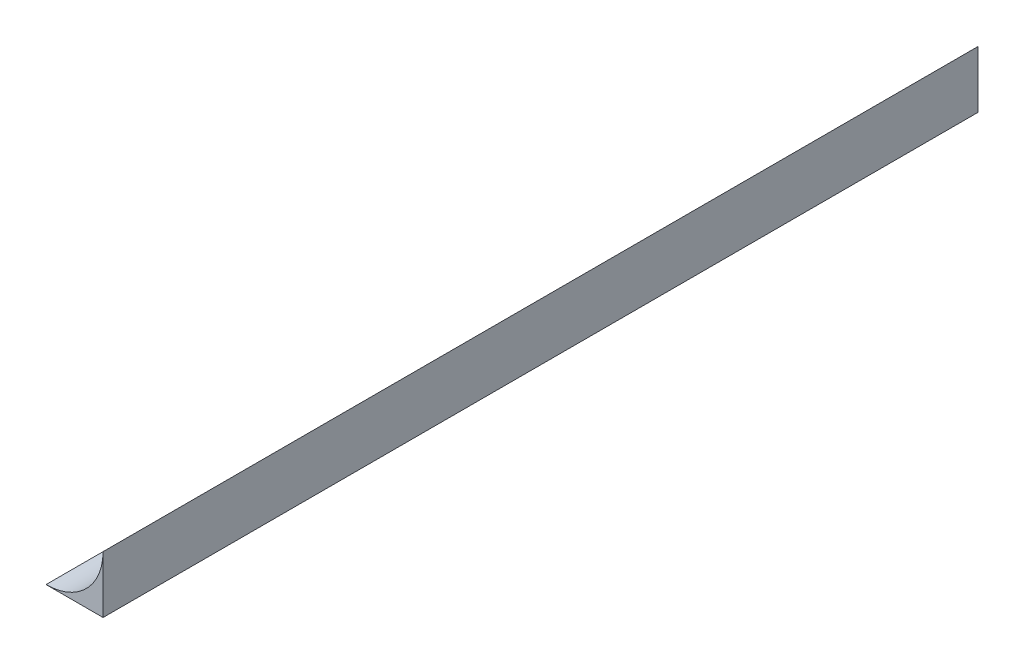
ISO-10303-21;
HEADER;
FILE_DESCRIPTION(('STEP AP214'),'2;1');
FILE_NAME('part.step','',(''),(''),'','','');
FILE_SCHEMA(('AUTOMOTIVE_DESIGN { 1 0 10303 214 1 1 1 1 }'));
ENDSEC;
DATA;
#1=APPLICATION_CONTEXT('core data for automotive mechanical design processes');
#2=APPLICATION_PROTOCOL_DEFINITION('international standard','automotive_design',2000,#1);
#3=PRODUCT_CONTEXT('',#1,'mechanical');
#4=PRODUCT('Part','Part','',(#3));
#5=PRODUCT_RELATED_PRODUCT_CATEGORY('part','',(#4));
#6=PRODUCT_DEFINITION_FORMATION('','',#4);
#7=PRODUCT_DEFINITION_CONTEXT('part definition',#1,'design');
#8=PRODUCT_DEFINITION('design','',#6,#7);
#9=PRODUCT_DEFINITION_SHAPE('','',#8);
#10=(LENGTH_UNIT() NAMED_UNIT(*) SI_UNIT(.MILLI.,.METRE.));
#11=(NAMED_UNIT(*) PLANE_ANGLE_UNIT() SI_UNIT($,.RADIAN.));
#12=(NAMED_UNIT(*) SI_UNIT($,.STERADIAN.) SOLID_ANGLE_UNIT());
#13=UNCERTAINTY_MEASURE_WITH_UNIT(LENGTH_MEASURE(1.E-05),#10,'distance_accuracy_value','');
#14=(GEOMETRIC_REPRESENTATION_CONTEXT(3) GLOBAL_UNCERTAINTY_ASSIGNED_CONTEXT((#13)) GLOBAL_UNIT_ASSIGNED_CONTEXT((#10,
#11,#12)) REPRESENTATION_CONTEXT('',''));
#15=CARTESIAN_POINT('',(0.,0.,0.));
#16=DIRECTION('',(0.,0.,1.));
#17=DIRECTION('',(1.,0.,0.));
#18=AXIS2_PLACEMENT_3D('',#15,#16,#17);
#19=CARTESIAN_POINT('',(-130.,52.0000000000002,0.));
#20=DIRECTION('',(0.,0.,1.));
#21=DIRECTION('',(0.,-1.,0.));
#22=AXIS2_PLACEMENT_3D('',#19,#20,#21);
#23=CYLINDRICAL_SURFACE('',#22,15.);
#24=CARTESIAN_POINT('',(-121.,40.,73.));
#25=CARTESIAN_POINT('',(-120.797057072228,40.1522174054446,72.9999977927953));
#26=CARTESIAN_POINT('',(-120.597701329312,40.3098633624881,72.9793924118525));
#27=CARTESIAN_POINT('',(-120.308154316818,40.55080060245,72.9208094612382));
#28=CARTESIAN_POINT('',(-120.213030786577,40.632032353957,72.8965894837349));
#29=CARTESIAN_POINT('',(-120.026317009639,40.7954927156775,72.8392717260157));
#30=CARTESIAN_POINT('',(-119.934726738886,40.8777213190987,72.8061740062583));
#31=CARTESIAN_POINT('',(-119.74905229858,41.0485104279241,72.7287307262232));
#32=CARTESIAN_POINT('',(-119.655262765118,41.1371008698239,72.683747268262));
#33=CARTESIAN_POINT('',(-119.472661372362,41.313967620845,72.5841916306262));
#34=CARTESIAN_POINT('',(-119.383848085223,41.4022440131981,72.529622220243));
#35=CARTESIAN_POINT('',(-119.21169083469,41.5775503289673,72.4109895595326));
#36=CARTESIAN_POINT('',(-119.128341454555,41.6645814178977,72.3469359233702));
#37=CARTESIAN_POINT('',(-118.967575577733,41.836366181023,72.2091738414463));
#38=CARTESIAN_POINT('',(-118.890156448988,41.9211208545985,72.1354697187337));
#39=CARTESIAN_POINT('',(-118.718528414286,42.1131534550002,71.9532373542073));
#40=CARTESIAN_POINT('',(-118.626694581793,42.2191338527398,71.8410462657974));
#41=CARTESIAN_POINT('',(-118.456758060844,42.4202913252589,71.5980760338289));
#42=CARTESIAN_POINT('',(-118.378633729717,42.5154853423484,71.4673267885637));
#43=CARTESIAN_POINT('',(-118.258998930605,42.6642948092194,71.2246767882859));
#44=CARTESIAN_POINT('',(-118.213325827111,42.7221486721382,71.117464061298));
#45=CARTESIAN_POINT('',(-118.133467450503,42.8245098489895,70.8928229685946));
#46=CARTESIAN_POINT('',(-118.099263285226,42.869039098688,70.7754118079922));
#47=CARTESIAN_POINT('',(-118.049957820365,42.9336972245061,70.5545946442233));
#48=CARTESIAN_POINT('',(-118.032495563605,42.9568131623828,70.4526050032231));
#49=CARTESIAN_POINT('',(-118.008220744942,42.9890259608883,70.245204380083));
#50=CARTESIAN_POINT('',(-118.001398509047,42.9981355560867,70.1397965948797));
#51=CARTESIAN_POINT('',(-117.998989187519,43.0013475264529,69.9284107226748));
#52=CARTESIAN_POINT('',(-118.003423807159,42.9954209090684,69.8224319276819));
#53=CARTESIAN_POINT('',(-118.023167799293,42.9691780704006,69.613305538068));
#54=CARTESIAN_POINT('',(-118.03848590117,42.948850298332,69.5101602851857));
#55=CARTESIAN_POINT('',(-118.083506289404,42.8896301139918,69.2858510667955));
#56=CARTESIAN_POINT('',(-118.115719614978,42.8475268479826,69.166051855412));
#57=CARTESIAN_POINT('',(-118.19217759987,42.749096679101,68.9365904688598));
#58=CARTESIAN_POINT('',(-118.236445886728,42.6927418590395,68.826948773882));
#59=CARTESIAN_POINT('',(-118.358174512877,42.5405443051896,68.568259036926));
#60=CARTESIAN_POINT('',(-118.441378215187,42.4387148745273,68.4254821808397));
#61=CARTESIAN_POINT('',(-118.623878875643,42.2222683932134,68.1615553679394));
#62=CARTESIAN_POINT('',(-118.723212124078,42.1076226924612,68.0404555054716));
#63=CARTESIAN_POINT('',(-118.904493312211,41.9053198630733,67.8504063180705));
#64=CARTESIAN_POINT('',(-118.983229705148,41.819379026753,67.7764730701752));
#65=CARTESIAN_POINT('',(-119.146727522353,41.6452556460058,67.6384676120057));
#66=CARTESIAN_POINT('',(-119.231491287131,41.5570722393912,67.574399263311));
#67=CARTESIAN_POINT('',(-119.406537240407,41.3795430651524,67.4559782340394));
#68=CARTESIAN_POINT('',(-119.496823141455,41.2901965480501,67.4016321883171));
#69=CARTESIAN_POINT('',(-119.682406740321,41.1112958256178,67.3027794646786));
#70=CARTESIAN_POINT('',(-119.77770376302,41.0217416498106,67.258271465521));
#71=CARTESIAN_POINT('',(-119.974285274796,40.8419068981934,67.1787752777045));
#72=CARTESIAN_POINT('',(-120.075635921277,40.7516342612607,67.1439324029462));
#73=CARTESIAN_POINT('',(-120.28255188401,40.5724045968713,67.0850665817684));
#74=CARTESIAN_POINT('',(-120.388116892609,40.4834474740274,67.0610428471014));
#75=CARTESIAN_POINT('',(-120.602731025415,40.3076719584561,67.0244316344465));
#76=CARTESIAN_POINT('',(-120.711775208581,40.2208508178736,67.0118286252978));
#77=CARTESIAN_POINT('',(-120.932664859562,40.0499810640971,66.9987158790101));
#78=CARTESIAN_POINT('',(-121.044509508771,39.9659316569621,66.9982026482706));
#79=CARTESIAN_POINT('',(-121.331738655649,39.7563198605775,67.0132887243839));
#80=CARTESIAN_POINT('',(-121.508497682384,39.6331268770398,67.0378315160276));
#81=CARTESIAN_POINT('',(-121.861753219254,39.3978634308245,67.1207292322723));
#82=CARTESIAN_POINT('',(-122.038249796266,39.2857893492501,67.1790731129833));
#83=CARTESIAN_POINT('',(-122.298214359706,39.127819307445,67.2937561058334));
#84=CARTESIAN_POINT('',(-122.384482592007,39.0766276813842,67.3367899360425));
#85=CARTESIAN_POINT('',(-122.554096112296,38.9781687426978,67.432076800961));
#86=CARTESIAN_POINT('',(-122.637442919537,38.9308993723233,67.4843249559743));
#87=CARTESIAN_POINT('',(-122.800044458511,38.840619426391,67.5979844758074));
#88=CARTESIAN_POINT('',(-122.879300867386,38.7976070986175,67.6593920442639));
#89=CARTESIAN_POINT('',(-123.032530492183,38.7161039132678,67.7911491508635));
#90=CARTESIAN_POINT('',(-123.106504816182,38.6776121062765,67.8614968048945));
#91=CARTESIAN_POINT('',(-123.237484896901,38.6107140831353,67.999664938308));
#92=CARTESIAN_POINT('',(-123.295383895437,38.5816577367595,68.0663268567764));
#93=CARTESIAN_POINT('',(-123.405680954729,38.5271109064594,68.2054042050856));
#94=CARTESIAN_POINT('',(-123.45807990364,38.5016198465857,68.2778187026633));
#95=CARTESIAN_POINT('',(-123.556637578558,38.4542969201322,68.4278515352118));
#96=CARTESIAN_POINT('',(-123.602799734153,38.4324630408854,68.5054669747852));
#97=CARTESIAN_POINT('',(-123.688252239388,38.3924998834528,68.6652629761306));
#98=CARTESIAN_POINT('',(-123.727543232625,38.3743702582754,68.7474431093924));
#99=CARTESIAN_POINT('',(-123.826064973673,38.3293244261949,68.9804853829526));
#100=CARTESIAN_POINT('',(-123.877401977517,38.3063688379322,69.1355769002148));
#101=CARTESIAN_POINT('',(-123.954264918678,38.2722586667104,69.4531608308171));
#102=CARTESIAN_POINT('',(-123.979800305376,38.2610997633567,69.6156505119107));
#103=CARTESIAN_POINT('',(-124.00335678942,38.2508030303214,69.9350221061431));
#104=CARTESIAN_POINT('',(-124.002655965275,38.2511068101148,70.0917922749454));
#105=CARTESIAN_POINT('',(-123.976914708434,38.262364146139,70.4029142629871));
#106=CARTESIAN_POINT('',(-123.95187718616,38.2733164289173,70.5572663691595));
#107=CARTESIAN_POINT('',(-123.878858094909,38.3057244940787,70.8578406376436));
#108=CARTESIAN_POINT('',(-123.831077258623,38.3270884218057,71.0041216667716));
#109=CARTESIAN_POINT('',(-123.714641385584,38.3802225212054,71.2860758617496));
#110=CARTESIAN_POINT('',(-123.6459856759,38.4119930283515,71.4217486854519));
#111=CARTESIAN_POINT('',(-123.488866162904,38.4865685425927,71.6820082882229));
#112=CARTESIAN_POINT('',(-123.400002588645,38.5295993374239,71.8062883252061));
#113=CARTESIAN_POINT('',(-123.206922851938,38.6259309548717,72.0376989264209));
#114=CARTESIAN_POINT('',(-123.102704871565,38.6792329938102,72.1448274568156));
#115=CARTESIAN_POINT('',(-122.87614414781,38.7989387141019,72.3461454519451));
#116=CARTESIAN_POINT('',(-122.75309043645,38.8659350197007,72.4391789973649));
#117=CARTESIAN_POINT('',(-122.498414412184,39.009710619008,72.6034112360307));
#118=CARTESIAN_POINT('',(-122.366786464314,39.0864963786976,72.6745953907881));
#119=CARTESIAN_POINT('',(-122.084109099931,39.2575949899679,72.8020257215924));
#120=CARTESIAN_POINT('',(-121.932527280025,39.3529073472835,72.8557317381524));
#121=CARTESIAN_POINT('',(-121.628389326607,39.5521422204349,72.9376730783265));
#122=CARTESIAN_POINT('',(-121.475834007175,39.6560582390291,72.9659274341675));
#123=CARTESIAN_POINT('',(-121.270065892474,39.8019369602416,72.9883228220883));
#124=CARTESIAN_POINT('',(-121.215732439846,39.8410066003587,72.9927239962523));
#125=CARTESIAN_POINT('',(-121.107515940377,39.9199246847551,72.9985622167554));
#126=CARTESIAN_POINT('',(-121.053632703586,39.9597727741666,73.0000005833086));
#127=CARTESIAN_POINT('',(-121.,40.,73.));
#128=B_SPLINE_CURVE_WITH_KNOTS('',3,(#24,#25,#26,#27,#28,#29,#30,#31,#32,#33,#34,#35,#36,#37,
#38,#39,#40,#41,#42,#43,#44,#45,#46,#47,#48,#49,#50,#51,#52,#53,#54,#55,#56,#57,#58,#59,#60,#61,
#62,#63,#64,#65,#66,#67,#68,#69,#70,#71,#72,#73,#74,#75,#76,#77,#78,#79,#80,#81,#82,#83,#84,#85,
#86,#87,#88,#89,#90,#91,#92,#93,#94,#95,#96,#97,#98,#99,#100,#101,#102,#103,#104,#105,#106,#107,
#108,#109,#110,#111,#112,#113,#114,#115,#116,#117,#118,#119,#120,#121,#122,#123,#124,#125,#126,
#127),.UNSPECIFIED.,.T.,.F.,(4,2,2,2,2,2,2,2,2,2,2,2,2,2,2,2,2,2,2,2,2,2,2,2,2,2,2,2,2,2,2,2,2,
2,2,2,2,2,2,2,2,2,2,2,2,2,2,2,2,2,2,4),(0.,0.760786666743888,1.14278137474352,1.52477348137761,
1.93424732350509,2.34360306645045,2.75254665074153,3.16130766671145,3.69859728150022,
4.23503091396096,4.62411272265274,5.01255043264049,5.32927360238405,5.64570863671824,
5.96275427887032,6.28005450327093,6.67089820437208,7.06251353639037,7.64165606743534,
8.22212015619734,8.63571091220358,9.04946315747914,9.46349669413512,9.87747459260754,
10.297375411655,10.7172456331342,11.1365440081959,11.5557212165229,12.2035941201185,
12.8512554623346,13.1783019870993,13.5051758327483,13.8319145713563,14.158584564006,
14.4370560730471,14.7154825446987,14.9937552820385,15.2720019405549,15.7641670401542,
16.2561518276675,16.7242026154998,17.1921974361116,17.6561362277301,18.1200899766601,
18.5941739905638,19.068314180091,19.5707907770604,20.0736009985509,20.6323046424333,
21.1905901516038,21.3917365524228,21.592793303882),.UNSPECIFIED.);
#129=CARTESIAN_POINT('',(-121.,40.,73.));
#130=VERTEX_POINT('',#129);
#131=EDGE_CURVE('E103',#130,#130,#128,.T.);
#132=ORIENTED_EDGE('',*,*,#131,.F.);
#133=EDGE_LOOP('',(#132));
#134=FACE_BOUND('',#133,.T.);
#135=CARTESIAN_POINT('',(-130.,52.0000000000003,-115.));
#136=DIRECTION('',(0.,0.,-1.));
#137=DIRECTION('',(-1.,0.,0.));
#138=AXIS2_PLACEMENT_3D('',#135,#136,#137);
#139=CIRCLE('',#138,15.);
#140=CARTESIAN_POINT('',(-130.,37.0000000000002,-115.));
#141=VERTEX_POINT('',#140);
#142=CARTESIAN_POINT('',(-115.,52.0000000000003,-115.));
#143=VERTEX_POINT('',#142);
#144=EDGE_CURVE('E12',#141,#143,#139,.F.);
#145=ORIENTED_EDGE('',*,*,#144,.F.);
#146=DIRECTION('',(0.,0.,1.));
#147=VECTOR('',#146,1.);
#148=CARTESIAN_POINT('',(-130.,37.,115.));
#149=LINE('',#148,#147);
#150=CARTESIAN_POINT('',(-130.,36.9999999999999,115.));
#151=VERTEX_POINT('',#150);
#152=EDGE_CURVE('E62',#151,#141,#149,.F.);
#153=ORIENTED_EDGE('',*,*,#152,.F.);
#154=CARTESIAN_POINT('',(-130.,52.,115.));
#155=DIRECTION('',(0.,0.,1.));
#156=DIRECTION('',(1.,0.,0.));
#157=AXIS2_PLACEMENT_3D('',#154,#155,#156);
#158=CIRCLE('',#157,15.);
#159=CARTESIAN_POINT('',(-115.,52.,115.));
#160=VERTEX_POINT('',#159);
#161=EDGE_CURVE('E47',#160,#151,#158,.F.);
#162=ORIENTED_EDGE('',*,*,#161,.F.);
#163=DIRECTION('',(0.,0.,1.));
#164=VECTOR('',#163,1.);
#165=CARTESIAN_POINT('',(-115.,52.0000000000002,0.));
#166=LINE('',#165,#164);
#167=EDGE_CURVE('E91',#143,#160,#166,.T.);
#168=ORIENTED_EDGE('',*,*,#167,.F.);
#169=EDGE_LOOP('',(#145,#153,#162,#168));
#170=FACE_BOUND('',#169,.T.);
#171=CARTESIAN_POINT('',(-121.,40.0000000000002,-67.));
#172=CARTESIAN_POINT('',(-120.797057072228,40.1522174054448,-67.0000022072047));
#173=CARTESIAN_POINT('',(-120.597701329312,40.3098633624883,-67.0206075881475));
#174=CARTESIAN_POINT('',(-120.308154316818,40.5508006024502,-67.0791905387619));
#175=CARTESIAN_POINT('',(-120.213030786577,40.6320323539572,-67.1034105162651));
#176=CARTESIAN_POINT('',(-120.026317009639,40.7954927156777,-67.1607282739843));
#177=CARTESIAN_POINT('',(-119.934726738886,40.8777213190989,-67.1938259937417));
#178=CARTESIAN_POINT('',(-119.74905229858,41.0485104279243,-67.2712692737768));
#179=CARTESIAN_POINT('',(-119.655262765118,41.1371008698241,-67.316252731738));
#180=CARTESIAN_POINT('',(-119.472661372362,41.3139676208452,-67.4158083693738));
#181=CARTESIAN_POINT('',(-119.383848085223,41.4022440131982,-67.470377779757));
#182=CARTESIAN_POINT('',(-119.21169083469,41.5775503289675,-67.5890104404674));
#183=CARTESIAN_POINT('',(-119.128341454555,41.6645814178979,-67.6530640766298));
#184=CARTESIAN_POINT('',(-118.967575577733,41.8363661810232,-67.7908261585537));
#185=CARTESIAN_POINT('',(-118.890156448988,41.9211208545987,-67.8645302812663));
#186=CARTESIAN_POINT('',(-118.718528414286,42.1131534550004,-68.0467626457927));
#187=CARTESIAN_POINT('',(-118.626694581793,42.21913385274,-68.1589537342027));
#188=CARTESIAN_POINT('',(-118.456758060844,42.4202913252591,-68.4019239661711));
#189=CARTESIAN_POINT('',(-118.378633729717,42.5154853423486,-68.5326732114363));
#190=CARTESIAN_POINT('',(-118.258998930605,42.6642948092196,-68.7753232117141));
#191=CARTESIAN_POINT('',(-118.213325827111,42.7221486721384,-68.882535938702));
#192=CARTESIAN_POINT('',(-118.133467450503,42.8245098489897,-69.1071770314054));
#193=CARTESIAN_POINT('',(-118.099263285226,42.8690390986882,-69.2245881920078));
#194=CARTESIAN_POINT('',(-118.049957820365,42.9336972245063,-69.4454053557767));
#195=CARTESIAN_POINT('',(-118.032495563605,42.956813162383,-69.5473949967769));
#196=CARTESIAN_POINT('',(-118.008220744942,42.9890259608885,-69.754795619917));
#197=CARTESIAN_POINT('',(-118.001398509047,42.9981355560869,-69.8602034051203));
#198=CARTESIAN_POINT('',(-117.998989187519,43.0013475264531,-70.0715892773252));
#199=CARTESIAN_POINT('',(-118.003423807159,42.9954209090686,-70.1775680723181));
#200=CARTESIAN_POINT('',(-118.023167799293,42.9691780704008,-70.3866944619321));
#201=CARTESIAN_POINT('',(-118.03848590117,42.9488502983322,-70.4898397148143));
#202=CARTESIAN_POINT('',(-118.083506289404,42.889630113992,-70.7141489332045));
#203=CARTESIAN_POINT('',(-118.115719614978,42.8475268479828,-70.833948144588));
#204=CARTESIAN_POINT('',(-118.19217759987,42.7490966791012,-71.0634095311402));
#205=CARTESIAN_POINT('',(-118.236445886728,42.6927418590397,-71.173051226118));
#206=CARTESIAN_POINT('',(-118.358174512877,42.5405443051898,-71.431740963074));
#207=CARTESIAN_POINT('',(-118.441378215187,42.4387148745275,-71.5745178191603));
#208=CARTESIAN_POINT('',(-118.623878875643,42.2222683932136,-71.8384446320606));
#209=CARTESIAN_POINT('',(-118.723212124078,42.1076226924614,-71.9595444945285));
#210=CARTESIAN_POINT('',(-118.904493312211,41.9053198630735,-72.1495936819295));
#211=CARTESIAN_POINT('',(-118.983229705148,41.8193790267532,-72.2235269298248));
#212=CARTESIAN_POINT('',(-119.146727522353,41.6452556460059,-72.3615323879943));
#213=CARTESIAN_POINT('',(-119.231491287131,41.5570722393914,-72.425600736689));
#214=CARTESIAN_POINT('',(-119.406537240407,41.3795430651526,-72.5440217659606));
#215=CARTESIAN_POINT('',(-119.496823141455,41.2901965480503,-72.5983678116829));
#216=CARTESIAN_POINT('',(-119.682406740321,41.111295825618,-72.6972205353214));
#217=CARTESIAN_POINT('',(-119.77770376302,41.0217416498108,-72.741728534479));
#218=CARTESIAN_POINT('',(-119.974285274796,40.8419068981936,-72.8212247222955));
#219=CARTESIAN_POINT('',(-120.075635921277,40.7516342612609,-72.8560675970538));
#220=CARTESIAN_POINT('',(-120.28255188401,40.5724045968715,-72.9149334182316));
#221=CARTESIAN_POINT('',(-120.388116892609,40.4834474740276,-72.9389571528987));
#222=CARTESIAN_POINT('',(-120.602731025415,40.3076719584563,-72.9755683655535));
#223=CARTESIAN_POINT('',(-120.711775208581,40.2208508178738,-72.9881713747022));
#224=CARTESIAN_POINT('',(-120.932664859562,40.0499810640973,-73.00128412099));
#225=CARTESIAN_POINT('',(-121.044509508771,39.9659316569623,-73.0017973517294));
#226=CARTESIAN_POINT('',(-121.331738655649,39.7563198605777,-72.9867112756161));
#227=CARTESIAN_POINT('',(-121.508497682384,39.63312687704,-72.9621684839724));
#228=CARTESIAN_POINT('',(-121.861753219254,39.3978634308246,-72.8792707677277));
#229=CARTESIAN_POINT('',(-122.038249796266,39.2857893492503,-72.8209268870167));
#230=CARTESIAN_POINT('',(-122.298214359706,39.1278193074452,-72.7062438941666));
#231=CARTESIAN_POINT('',(-122.384482592007,39.0766276813844,-72.6632100639575));
#232=CARTESIAN_POINT('',(-122.554096112296,38.978168742698,-72.567923199039));
#233=CARTESIAN_POINT('',(-122.637442919537,38.9308993723235,-72.5156750440257));
#234=CARTESIAN_POINT('',(-122.800044458511,38.8406194263912,-72.4020155241926));
#235=CARTESIAN_POINT('',(-122.879300867386,38.7976070986177,-72.3406079557362));
#236=CARTESIAN_POINT('',(-123.032530492183,38.716103913268,-72.2088508491365));
#237=CARTESIAN_POINT('',(-123.106504816182,38.6776121062767,-72.1385031951055));
#238=CARTESIAN_POINT('',(-123.237484896901,38.6107140831355,-72.000335061692));
#239=CARTESIAN_POINT('',(-123.295383895437,38.5816577367597,-71.9336731432236));
#240=CARTESIAN_POINT('',(-123.405680954729,38.5271109064596,-71.7945957949144));
#241=CARTESIAN_POINT('',(-123.45807990364,38.5016198465859,-71.7221812973367));
#242=CARTESIAN_POINT('',(-123.556637578558,38.4542969201324,-71.5721484647882));
#243=CARTESIAN_POINT('',(-123.602799734153,38.4324630408856,-71.4945330252148));
#244=CARTESIAN_POINT('',(-123.688252239388,38.392499883453,-71.3347370238694));
#245=CARTESIAN_POINT('',(-123.727543232625,38.3743702582756,-71.2525568906076));
#246=CARTESIAN_POINT('',(-123.826064973673,38.3293244261951,-71.0195146170474));
#247=CARTESIAN_POINT('',(-123.877401977517,38.3063688379324,-70.8644230997852));
#248=CARTESIAN_POINT('',(-123.954264918678,38.2722586667106,-70.546839169183));
#249=CARTESIAN_POINT('',(-123.979800305376,38.2610997633569,-70.3843494880893));
#250=CARTESIAN_POINT('',(-124.00335678942,38.2508030303216,-70.0649778938569));
#251=CARTESIAN_POINT('',(-124.002655965275,38.251106810115,-69.9082077250547));
#252=CARTESIAN_POINT('',(-123.976914708434,38.2623641461392,-69.5970857370129));
#253=CARTESIAN_POINT('',(-123.95187718616,38.2733164289175,-69.4427336308405));
#254=CARTESIAN_POINT('',(-123.878858094909,38.3057244940789,-69.1421593623564));
#255=CARTESIAN_POINT('',(-123.831077258623,38.3270884218059,-68.9958783332285));
#256=CARTESIAN_POINT('',(-123.714641385584,38.3802225212056,-68.7139241382504));
#257=CARTESIAN_POINT('',(-123.6459856759,38.4119930283517,-68.5782513145482));
#258=CARTESIAN_POINT('',(-123.488866162904,38.4865685425929,-68.3179917117771));
#259=CARTESIAN_POINT('',(-123.400002588645,38.5295993374241,-68.1937116747939));
#260=CARTESIAN_POINT('',(-123.206922851938,38.6259309548719,-67.9623010735791));
#261=CARTESIAN_POINT('',(-123.102704871565,38.6792329938104,-67.8551725431844));
#262=CARTESIAN_POINT('',(-122.87614414781,38.7989387141021,-67.6538545480549));
#263=CARTESIAN_POINT('',(-122.75309043645,38.8659350197009,-67.5608210026352));
#264=CARTESIAN_POINT('',(-122.498414412184,39.0097106190082,-67.3965887639693));
#265=CARTESIAN_POINT('',(-122.366786464314,39.0864963786978,-67.3254046092119));
#266=CARTESIAN_POINT('',(-122.084109099931,39.2575949899681,-67.1979742784077));
#267=CARTESIAN_POINT('',(-121.932527280025,39.3529073472837,-67.1442682618476));
#268=CARTESIAN_POINT('',(-121.628389326607,39.5521422204351,-67.0623269216735));
#269=CARTESIAN_POINT('',(-121.475834007175,39.6560582390293,-67.0340725658325));
#270=CARTESIAN_POINT('',(-121.270065892474,39.8019369602418,-67.0116771779117));
#271=CARTESIAN_POINT('',(-121.215732439846,39.8410066003589,-67.0072760037477));
#272=CARTESIAN_POINT('',(-121.107515940377,39.9199246847553,-67.0014377832446));
#273=CARTESIAN_POINT('',(-121.053632703586,39.9597727741668,-66.9999994166914));
#274=CARTESIAN_POINT('',(-121.,40.0000000000002,-67.));
#275=B_SPLINE_CURVE_WITH_KNOTS('',3,(#171,#172,#173,#174,#175,#176,#177,#178,#179,#180,#181,
#182,#183,#184,#185,#186,#187,#188,#189,#190,#191,#192,#193,#194,#195,#196,#197,#198,#199,#200,
#201,#202,#203,#204,#205,#206,#207,#208,#209,#210,#211,#212,#213,#214,#215,#216,#217,#218,#219,
#220,#221,#222,#223,#224,#225,#226,#227,#228,#229,#230,#231,#232,#233,#234,#235,#236,#237,#238,
#239,#240,#241,#242,#243,#244,#245,#246,#247,#248,#249,#250,#251,#252,#253,#254,#255,#256,#257,
#258,#259,#260,#261,#262,#263,#264,#265,#266,#267,#268,#269,#270,#271,#272,#273,#274),
.UNSPECIFIED.,.T.,.F.,(4,2,2,2,2,2,2,2,2,2,2,2,2,2,2,2,2,2,2,2,2,2,2,2,2,2,2,2,2,2,2,2,2,2,2,2,
2,2,2,2,2,2,2,2,2,2,2,2,2,2,2,4),(0.,0.760786666743888,1.14278137474352,1.52477348137761,
1.93424732350509,2.34360306645042,2.75254665074152,3.16130766671145,3.69859728150022,
4.23503091396096,4.62411272265273,5.01255043264049,5.32927360238405,5.64570863671824,
5.96275427887032,6.28005450327093,6.67089820437208,7.06251353639037,7.64165606743534,
8.22212015619734,8.63571091220359,9.04946315747915,9.46349669413512,9.87747459260754,
10.297375411655,10.7172456331342,11.1365440081959,11.5557212165229,12.2035941201185,
12.8512554623347,13.1783019870993,13.5051758327483,13.8319145713563,14.158584564006,
14.4370560730471,14.7154825446987,14.9937552820385,15.2720019405549,15.7641670401542,
16.2561518276675,16.7242026154998,17.1921974361116,17.6561362277301,18.1200899766601,
18.5941739905639,19.068314180091,19.5707907770604,20.0736009985509,20.6323046424333,
21.1905901516038,21.3917365524228,21.592793303882),.UNSPECIFIED.);
#276=CARTESIAN_POINT('',(-121.,40.0000000000002,-67.));
#277=VERTEX_POINT('',#276);
#278=EDGE_CURVE('E38',#277,#277,#275,.T.);
#279=ORIENTED_EDGE('',*,*,#278,.F.);
#280=EDGE_LOOP('',(#279));
#281=FACE_BOUND('',#280,.T.);
#282=ADVANCED_FACE('F34',(#134,#170,#281),#23,.F.);
#283=CARTESIAN_POINT('',(-121.,52.0000000000003,70.));
#284=DIRECTION('',(0.,-1.,0.));
#285=DIRECTION('',(0.,0.,-1.));
#286=AXIS2_PLACEMENT_3D('',#283,#284,#285);
#287=CYLINDRICAL_SURFACE('',#286,1.2);
#288=CARTESIAN_POINT('',(-121.,37.,70.));
#289=DIRECTION('',(0.,-1.,0.));
#290=DIRECTION('',(0.,0.,1.));
#291=AXIS2_PLACEMENT_3D('',#288,#289,#290);
#292=CIRCLE('',#291,1.2);
#293=CARTESIAN_POINT('',(-121.,37.,71.2));
#294=VERTEX_POINT('',#293);
#295=EDGE_CURVE('E148',#294,#294,#292,.T.);
#296=ORIENTED_EDGE('',*,*,#295,.T.);
#297=EDGE_LOOP('',(#296));
#298=FACE_BOUND('',#297,.T.);
#299=CARTESIAN_POINT('',(-121.,38.,70.));
#300=DIRECTION('',(0.,1.,0.));
#301=DIRECTION('',(0.,0.,1.));
#302=AXIS2_PLACEMENT_3D('',#299,#300,#301);
#303=CIRCLE('',#302,1.2);
#304=CARTESIAN_POINT('',(-121.,38.,71.2));
#305=VERTEX_POINT('',#304);
#306=EDGE_CURVE('E100',#305,#305,#303,.F.);
#307=ORIENTED_EDGE('',*,*,#306,.F.);
#308=EDGE_LOOP('',(#307));
#309=FACE_BOUND('',#308,.T.);
#310=ADVANCED_FACE('F122',(#298,#309),#287,.F.);
#311=CARTESIAN_POINT('',(-110.,0.,-115.));
#312=DIRECTION('',(0.,0.,-1.));
#313=DIRECTION('',(-1.,0.,0.));
#314=AXIS2_PLACEMENT_3D('',#311,#312,#313);
#315=PLANE('',#314);
#316=DIRECTION('',(1.,0.,0.));
#317=VECTOR('',#316,1.);
#318=CARTESIAN_POINT('',(-110.,37.,-115.));
#319=LINE('',#318,#317);
#320=CARTESIAN_POINT('',(-115.,37.,-115.));
#321=VERTEX_POINT('',#320);
#322=EDGE_CURVE('E73',#141,#321,#319,.T.);
#323=ORIENTED_EDGE('',*,*,#322,.F.);
#324=ORIENTED_EDGE('',*,*,#144,.T.);
#325=DIRECTION('',(0.,1.,0.));
#326=VECTOR('',#325,1.);
#327=CARTESIAN_POINT('',(-115.,0.,-115.));
#328=LINE('',#327,#326);
#329=EDGE_CURVE('E55',#321,#143,#328,.T.);
#330=ORIENTED_EDGE('',*,*,#329,.F.);
#331=EDGE_LOOP('',(#323,#324,#330));
#332=FACE_BOUND('',#331,.T.);
#333=ADVANCED_FACE('F86',(#332),#315,.T.);
#334=CARTESIAN_POINT('',(-110.,0.,115.));
#335=DIRECTION('',(0.,0.,1.));
#336=DIRECTION('',(1.,0.,0.));
#337=AXIS2_PLACEMENT_3D('',#334,#335,#336);
#338=PLANE('',#337);
#339=DIRECTION('',(-1.,0.,0.));
#340=VECTOR('',#339,1.);
#341=CARTESIAN_POINT('',(-110.,37.,115.));
#342=LINE('',#341,#340);
#343=CARTESIAN_POINT('',(-115.,37.,115.));
#344=VERTEX_POINT('',#343);
#345=EDGE_CURVE('E79',#344,#151,#342,.T.);
#346=ORIENTED_EDGE('',*,*,#345,.F.);
#347=DIRECTION('',(0.,-1.,0.));
#348=VECTOR('',#347,1.);
#349=CARTESIAN_POINT('',(-115.,0.,115.));
#350=LINE('',#349,#348);
#351=EDGE_CURVE('E83',#160,#344,#350,.T.);
#352=ORIENTED_EDGE('',*,*,#351,.F.);
#353=ORIENTED_EDGE('',*,*,#161,.T.);
#354=EDGE_LOOP('',(#346,#352,#353));
#355=FACE_BOUND('',#354,.T.);
#356=ADVANCED_FACE('F131',(#355),#338,.T.);
#357=CARTESIAN_POINT('',(-115.,37.,-174.));
#358=DIRECTION('',(-1.,0.,0.));
#359=DIRECTION('',(0.,0.,1.));
#360=AXIS2_PLACEMENT_3D('',#357,#358,#359);
#361=PLANE('',#360);
#362=ORIENTED_EDGE('',*,*,#329,.T.);
#363=ORIENTED_EDGE('',*,*,#167,.T.);
#364=ORIENTED_EDGE('',*,*,#351,.T.);
#365=DIRECTION('',(0.,0.,1.));
#366=VECTOR('',#365,1.);
#367=CARTESIAN_POINT('',(-115.,37.,-174.));
#368=LINE('',#367,#366);
#369=EDGE_CURVE('E75',#321,#344,#368,.T.);
#370=ORIENTED_EDGE('',*,*,#369,.F.);
#371=EDGE_LOOP('',(#362,#363,#364,#370));
#372=FACE_BOUND('',#371,.T.);
#373=ADVANCED_FACE('F81',(#372),#361,.F.);
#374=CARTESIAN_POINT('',(-130.,37.,-174.));
#375=DIRECTION('',(0.,1.,0.));
#376=DIRECTION('',(0.,0.,1.));
#377=AXIS2_PLACEMENT_3D('',#374,#375,#376);
#378=PLANE('',#377);
#379=CARTESIAN_POINT('',(-121.,37.,-70.));
#380=DIRECTION('',(0.,-1.,0.));
#381=DIRECTION('',(0.,0.,-1.));
#382=AXIS2_PLACEMENT_3D('',#379,#380,#381);
#383=CIRCLE('',#382,1.2);
#384=CARTESIAN_POINT('',(-121.,37.,-71.2));
#385=VERTEX_POINT('',#384);
#386=EDGE_CURVE('E84',#385,#385,#383,.T.);
#387=ORIENTED_EDGE('',*,*,#386,.F.);
#388=EDGE_LOOP('',(#387));
#389=FACE_BOUND('',#388,.T.);
#390=ORIENTED_EDGE('',*,*,#295,.F.);
#391=EDGE_LOOP('',(#390));
#392=FACE_BOUND('',#391,.T.);
#393=ORIENTED_EDGE('',*,*,#345,.T.);
#394=ORIENTED_EDGE('',*,*,#152,.T.);
#395=ORIENTED_EDGE('',*,*,#322,.T.);
#396=ORIENTED_EDGE('',*,*,#369,.T.);
#397=EDGE_LOOP('',(#393,#394,#395,#396));
#398=FACE_BOUND('',#397,.T.);
#399=ADVANCED_FACE('F74',(#389,#392,#398),#378,.F.);
#400=CARTESIAN_POINT('',(-121.,52.0000000000003,-70.));
#401=DIRECTION('',(0.,-1.,0.));
#402=DIRECTION('',(0.,0.,-1.));
#403=AXIS2_PLACEMENT_3D('',#400,#401,#402);
#404=CYLINDRICAL_SURFACE('',#403,1.2);
#405=CARTESIAN_POINT('',(-121.,38.,-70.));
#406=DIRECTION('',(0.,-1.,0.));
#407=DIRECTION('',(0.,0.,-1.));
#408=AXIS2_PLACEMENT_3D('',#405,#406,#407);
#409=CIRCLE('',#408,1.2);
#410=CARTESIAN_POINT('',(-121.,38.,-71.2));
#411=VERTEX_POINT('',#410);
#412=EDGE_CURVE('E97',#411,#411,#409,.F.);
#413=ORIENTED_EDGE('',*,*,#412,.T.);
#414=EDGE_LOOP('',(#413));
#415=FACE_BOUND('',#414,.T.);
#416=ORIENTED_EDGE('',*,*,#386,.T.);
#417=EDGE_LOOP('',(#416));
#418=FACE_BOUND('',#417,.T.);
#419=ADVANCED_FACE('F117',(#415,#418),#404,.F.);
#420=CARTESIAN_POINT('',(-121.,38.,-70.));
#421=DIRECTION('',(0.,1.,0.));
#422=DIRECTION('',(0.,0.,1.));
#423=AXIS2_PLACEMENT_3D('',#420,#421,#422);
#424=CYLINDRICAL_SURFACE('',#423,3.00000000000001);
#425=CARTESIAN_POINT('',(-121.,38.,-70.));
#426=DIRECTION('',(0.,-1.,0.));
#427=DIRECTION('',(0.,0.,-1.));
#428=AXIS2_PLACEMENT_3D('',#425,#426,#427);
#429=CIRCLE('',#428,3.00000000000001);
#430=CARTESIAN_POINT('',(-121.,38.,-73.));
#431=VERTEX_POINT('',#430);
#432=EDGE_CURVE('E101',#431,#431,#429,.T.);
#433=ORIENTED_EDGE('',*,*,#432,.T.);
#434=EDGE_LOOP('',(#433));
#435=FACE_BOUND('',#434,.T.);
#436=ORIENTED_EDGE('',*,*,#278,.T.);
#437=EDGE_LOOP('',(#436));
#438=FACE_BOUND('',#437,.T.);
#439=ADVANCED_FACE('F120',(#435,#438),#424,.F.);
#440=CARTESIAN_POINT('',(-121.,38.,-70.));
#441=DIRECTION('',(0.,-1.,0.));
#442=DIRECTION('',(0.,0.,-1.));
#443=AXIS2_PLACEMENT_3D('',#440,#441,#442);
#444=PLANE('',#443);
#445=ORIENTED_EDGE('',*,*,#432,.F.);
#446=EDGE_LOOP('',(#445));
#447=FACE_BOUND('',#446,.T.);
#448=ORIENTED_EDGE('',*,*,#412,.F.);
#449=EDGE_LOOP('',(#448));
#450=FACE_BOUND('',#449,.T.);
#451=ADVANCED_FACE('F115',(#447,#450),#444,.F.);
#452=CARTESIAN_POINT('',(-121.,38.,70.));
#453=DIRECTION('',(0.,1.,0.));
#454=DIRECTION('',(0.,0.,1.));
#455=AXIS2_PLACEMENT_3D('',#452,#453,#454);
#456=CYLINDRICAL_SURFACE('',#455,3.00000000000001);
#457=CARTESIAN_POINT('',(-121.,38.,70.));
#458=DIRECTION('',(0.,-1.,0.));
#459=DIRECTION('',(0.,0.,1.));
#460=AXIS2_PLACEMENT_3D('',#457,#458,#459);
#461=CIRCLE('',#460,3.00000000000001);
#462=CARTESIAN_POINT('',(-121.,38.,73.));
#463=VERTEX_POINT('',#462);
#464=EDGE_CURVE('E155',#463,#463,#461,.T.);
#465=ORIENTED_EDGE('',*,*,#464,.T.);
#466=EDGE_LOOP('',(#465));
#467=FACE_BOUND('',#466,.T.);
#468=ORIENTED_EDGE('',*,*,#131,.T.);
#469=EDGE_LOOP('',(#468));
#470=FACE_BOUND('',#469,.T.);
#471=ADVANCED_FACE('F109',(#467,#470),#456,.F.);
#472=CARTESIAN_POINT('',(-121.,38.,70.));
#473=DIRECTION('',(0.,1.,0.));
#474=DIRECTION('',(0.,0.,1.));
#475=AXIS2_PLACEMENT_3D('',#472,#473,#474);
#476=PLANE('',#475);
#477=ORIENTED_EDGE('',*,*,#464,.F.);
#478=EDGE_LOOP('',(#477));
#479=FACE_BOUND('',#478,.T.);
#480=ORIENTED_EDGE('',*,*,#306,.T.);
#481=EDGE_LOOP('',(#480));
#482=FACE_BOUND('',#481,.T.);
#483=ADVANCED_FACE('F114',(#479,#482),#476,.T.);
#484=CLOSED_SHELL('',(#282,#310,#333,#356,#373,#399,#419,#439,#451,#471,#483));
#485=MANIFOLD_SOLID_BREP('B2',#484);
#486=ADVANCED_BREP_SHAPE_REPRESENTATION('',(#18,#485),#14);
#487=SHAPE_DEFINITION_REPRESENTATION(#9,#486);
ENDSEC;
END-ISO-10303-21;
